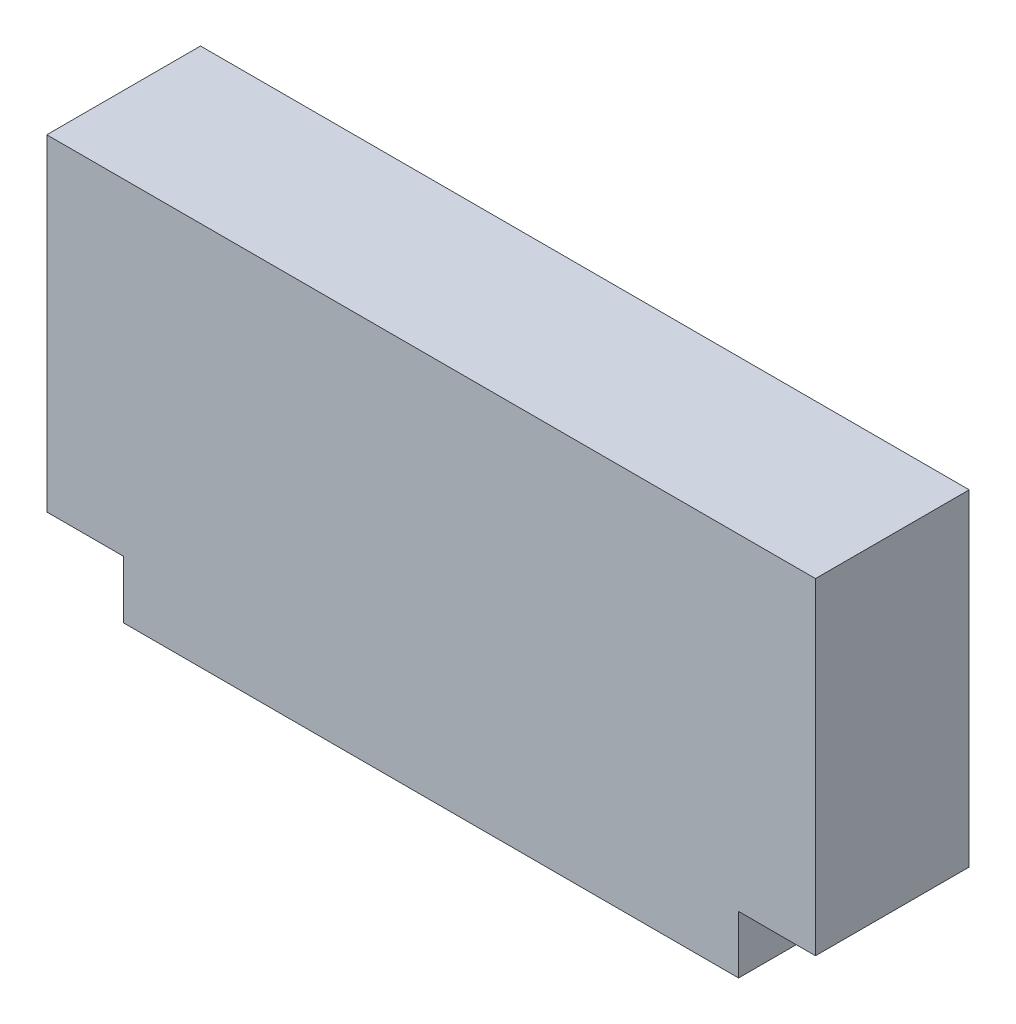
ISO-10303-21;
HEADER;
FILE_DESCRIPTION(('STEP AP214'),'2;1');
FILE_NAME('part.step','',(''),(''),'','','');
FILE_SCHEMA(('AUTOMOTIVE_DESIGN { 1 0 10303 214 1 1 1 1 }'));
ENDSEC;
DATA;
#1=APPLICATION_CONTEXT('core data for automotive mechanical design processes');
#2=APPLICATION_PROTOCOL_DEFINITION('international standard','automotive_design',2000,#1);
#3=PRODUCT_CONTEXT('',#1,'mechanical');
#4=PRODUCT('Part','Part','',(#3));
#5=PRODUCT_RELATED_PRODUCT_CATEGORY('part','',(#4));
#6=PRODUCT_DEFINITION_FORMATION('','',#4);
#7=PRODUCT_DEFINITION_CONTEXT('part definition',#1,'design');
#8=PRODUCT_DEFINITION('design','',#6,#7);
#9=PRODUCT_DEFINITION_SHAPE('','',#8);
#10=(LENGTH_UNIT() NAMED_UNIT(*) SI_UNIT(.MILLI.,.METRE.));
#11=(NAMED_UNIT(*) PLANE_ANGLE_UNIT() SI_UNIT($,.RADIAN.));
#12=(NAMED_UNIT(*) SI_UNIT($,.STERADIAN.) SOLID_ANGLE_UNIT());
#13=UNCERTAINTY_MEASURE_WITH_UNIT(LENGTH_MEASURE(1.E-05),#10,'distance_accuracy_value','');
#14=(GEOMETRIC_REPRESENTATION_CONTEXT(3) GLOBAL_UNCERTAINTY_ASSIGNED_CONTEXT((#13)) GLOBAL_UNIT_ASSIGNED_CONTEXT((#10,
#11,#12)) REPRESENTATION_CONTEXT('',''));
#15=CARTESIAN_POINT('',(0.,0.,0.));
#16=DIRECTION('',(0.,0.,1.));
#17=DIRECTION('',(1.,0.,0.));
#18=AXIS2_PLACEMENT_3D('',#15,#16,#17);
#19=CARTESIAN_POINT('',(20.,3.,8.));
#20=DIRECTION('',(-1.,0.,0.));
#21=DIRECTION('',(0.,-1.,0.));
#22=AXIS2_PLACEMENT_3D('',#19,#20,#21);
#23=PLANE('',#22);
#24=DIRECTION('',(0.,1.,0.));
#25=VECTOR('',#24,1.);
#26=CARTESIAN_POINT('',(20.,3.,0.));
#27=LINE('',#26,#25);
#28=CARTESIAN_POINT('',(20.,3.,0.));
#29=VERTEX_POINT('',#28);
#30=CARTESIAN_POINT('',(20.,20.,0.));
#31=VERTEX_POINT('',#30);
#32=EDGE_CURVE('E130',#29,#31,#27,.T.);
#33=ORIENTED_EDGE('',*,*,#32,.T.);
#34=DIRECTION('',(0.,0.,-1.));
#35=VECTOR('',#34,1.);
#36=CARTESIAN_POINT('',(20.,20.,8.));
#37=LINE('',#36,#35);
#38=CARTESIAN_POINT('',(20.,20.,8.));
#39=VERTEX_POINT('',#38);
#40=EDGE_CURVE('E11',#39,#31,#37,.T.);
#41=ORIENTED_EDGE('',*,*,#40,.F.);
#42=DIRECTION('',(0.,1.,0.));
#43=VECTOR('',#42,1.);
#44=CARTESIAN_POINT('',(20.,3.,8.));
#45=LINE('',#44,#43);
#46=CARTESIAN_POINT('',(20.,3.,8.));
#47=VERTEX_POINT('',#46);
#48=EDGE_CURVE('E144',#47,#39,#45,.T.);
#49=ORIENTED_EDGE('',*,*,#48,.F.);
#50=DIRECTION('',(0.,0.,-1.));
#51=VECTOR('',#50,1.);
#52=CARTESIAN_POINT('',(20.,3.,8.));
#53=LINE('',#52,#51);
#54=EDGE_CURVE('E126',#47,#29,#53,.T.);
#55=ORIENTED_EDGE('',*,*,#54,.T.);
#56=EDGE_LOOP('',(#33,#41,#49,#55));
#57=FACE_BOUND('',#56,.T.);
#58=ADVANCED_FACE('F34',(#57),#23,.F.);
#59=CARTESIAN_POINT('',(-20.,20.,8.));
#60=DIRECTION('',(0.,-1.,0.));
#61=DIRECTION('',(0.,0.,-1.));
#62=AXIS2_PLACEMENT_3D('',#59,#60,#61);
#63=PLANE('',#62);
#64=DIRECTION('',(-1.,0.,0.));
#65=VECTOR('',#64,1.);
#66=CARTESIAN_POINT('',(-20.,20.,0.));
#67=LINE('',#66,#65);
#68=CARTESIAN_POINT('',(-20.,20.,0.));
#69=VERTEX_POINT('',#68);
#70=EDGE_CURVE('E133',#31,#69,#67,.T.);
#71=ORIENTED_EDGE('',*,*,#70,.T.);
#72=DIRECTION('',(0.,0.,-1.));
#73=VECTOR('',#72,1.);
#74=CARTESIAN_POINT('',(-20.,20.,8.));
#75=LINE('',#74,#73);
#76=CARTESIAN_POINT('',(-20.,20.,8.));
#77=VERTEX_POINT('',#76);
#78=EDGE_CURVE('E42',#77,#69,#75,.T.);
#79=ORIENTED_EDGE('',*,*,#78,.F.);
#80=DIRECTION('',(-1.,0.,0.));
#81=VECTOR('',#80,1.);
#82=CARTESIAN_POINT('',(-20.,20.,8.));
#83=LINE('',#82,#81);
#84=EDGE_CURVE('E93',#39,#77,#83,.T.);
#85=ORIENTED_EDGE('',*,*,#84,.F.);
#86=ORIENTED_EDGE('',*,*,#40,.T.);
#87=EDGE_LOOP('',(#71,#79,#85,#86));
#88=FACE_BOUND('',#87,.T.);
#89=ADVANCED_FACE('F179',(#88),#63,.F.);
#90=CARTESIAN_POINT('',(-20.,3.,8.));
#91=DIRECTION('',(1.,0.,0.));
#92=DIRECTION('',(0.,0.,-1.));
#93=AXIS2_PLACEMENT_3D('',#90,#91,#92);
#94=PLANE('',#93);
#95=DIRECTION('',(0.,-1.,0.));
#96=VECTOR('',#95,1.);
#97=CARTESIAN_POINT('',(-20.,3.,0.));
#98=LINE('',#97,#96);
#99=CARTESIAN_POINT('',(-20.,3.,0.));
#100=VERTEX_POINT('',#99);
#101=EDGE_CURVE('E135',#69,#100,#98,.T.);
#102=ORIENTED_EDGE('',*,*,#101,.T.);
#103=DIRECTION('',(0.,0.,-1.));
#104=VECTOR('',#103,1.);
#105=CARTESIAN_POINT('',(-20.,3.,8.));
#106=LINE('',#105,#104);
#107=CARTESIAN_POINT('',(-20.,3.,8.));
#108=VERTEX_POINT('',#107);
#109=EDGE_CURVE('E151',#108,#100,#106,.T.);
#110=ORIENTED_EDGE('',*,*,#109,.F.);
#111=DIRECTION('',(0.,-1.,0.));
#112=VECTOR('',#111,1.);
#113=CARTESIAN_POINT('',(-20.,3.,8.));
#114=LINE('',#113,#112);
#115=EDGE_CURVE('E159',#77,#108,#114,.T.);
#116=ORIENTED_EDGE('',*,*,#115,.F.);
#117=ORIENTED_EDGE('',*,*,#78,.T.);
#118=EDGE_LOOP('',(#102,#110,#116,#117));
#119=FACE_BOUND('',#118,.T.);
#120=ADVANCED_FACE('F157',(#119),#94,.F.);
#121=CARTESIAN_POINT('',(-20.,3.,8.));
#122=DIRECTION('',(0.,1.,0.));
#123=DIRECTION('',(0.,0.,1.));
#124=AXIS2_PLACEMENT_3D('',#121,#122,#123);
#125=PLANE('',#124);
#126=DIRECTION('',(1.,0.,0.));
#127=VECTOR('',#126,1.);
#128=CARTESIAN_POINT('',(-20.,3.,0.));
#129=LINE('',#128,#127);
#130=CARTESIAN_POINT('',(-16.,3.,0.));
#131=VERTEX_POINT('',#130);
#132=EDGE_CURVE('E137',#100,#131,#129,.T.);
#133=ORIENTED_EDGE('',*,*,#132,.T.);
#134=DIRECTION('',(0.,0.,-1.));
#135=VECTOR('',#134,1.);
#136=CARTESIAN_POINT('',(-16.,3.,8.));
#137=LINE('',#136,#135);
#138=CARTESIAN_POINT('',(-16.,3.,8.));
#139=VERTEX_POINT('',#138);
#140=EDGE_CURVE('E148',#139,#131,#137,.T.);
#141=ORIENTED_EDGE('',*,*,#140,.F.);
#142=DIRECTION('',(1.,0.,0.));
#143=VECTOR('',#142,1.);
#144=CARTESIAN_POINT('',(-20.,3.,8.));
#145=LINE('',#144,#143);
#146=EDGE_CURVE('E171',#108,#139,#145,.T.);
#147=ORIENTED_EDGE('',*,*,#146,.F.);
#148=ORIENTED_EDGE('',*,*,#109,.T.);
#149=EDGE_LOOP('',(#133,#141,#147,#148));
#150=FACE_BOUND('',#149,.T.);
#151=ADVANCED_FACE('F167',(#150),#125,.F.);
#152=CARTESIAN_POINT('',(-16.,3.,8.));
#153=DIRECTION('',(1.,0.,0.));
#154=DIRECTION('',(0.,0.,-1.));
#155=AXIS2_PLACEMENT_3D('',#152,#153,#154);
#156=PLANE('',#155);
#157=DIRECTION('',(0.,-1.,0.));
#158=VECTOR('',#157,1.);
#159=CARTESIAN_POINT('',(-16.,3.,0.));
#160=LINE('',#159,#158);
#161=CARTESIAN_POINT('',(-16.,0.,0.));
#162=VERTEX_POINT('',#161);
#163=EDGE_CURVE('E139',#131,#162,#160,.T.);
#164=ORIENTED_EDGE('',*,*,#163,.T.);
#165=DIRECTION('',(0.,0.,-1.));
#166=VECTOR('',#165,1.);
#167=CARTESIAN_POINT('',(-16.,0.,8.));
#168=LINE('',#167,#166);
#169=CARTESIAN_POINT('',(-16.,0.,8.));
#170=VERTEX_POINT('',#169);
#171=EDGE_CURVE('E121',#170,#162,#168,.T.);
#172=ORIENTED_EDGE('',*,*,#171,.F.);
#173=DIRECTION('',(0.,-1.,0.));
#174=VECTOR('',#173,1.);
#175=CARTESIAN_POINT('',(-16.,3.,8.));
#176=LINE('',#175,#174);
#177=EDGE_CURVE('E112',#139,#170,#176,.T.);
#178=ORIENTED_EDGE('',*,*,#177,.F.);
#179=ORIENTED_EDGE('',*,*,#140,.T.);
#180=EDGE_LOOP('',(#164,#172,#178,#179));
#181=FACE_BOUND('',#180,.T.);
#182=ADVANCED_FACE('F170',(#181),#156,.F.);
#183=CARTESIAN_POINT('',(-16.,0.,8.));
#184=DIRECTION('',(0.,1.,0.));
#185=DIRECTION('',(0.,0.,1.));
#186=AXIS2_PLACEMENT_3D('',#183,#184,#185);
#187=PLANE('',#186);
#188=DIRECTION('',(1.,0.,0.));
#189=VECTOR('',#188,1.);
#190=CARTESIAN_POINT('',(-16.,0.,0.));
#191=LINE('',#190,#189);
#192=CARTESIAN_POINT('',(16.,0.,0.));
#193=VERTEX_POINT('',#192);
#194=EDGE_CURVE('E120',#162,#193,#191,.T.);
#195=ORIENTED_EDGE('',*,*,#194,.T.);
#196=DIRECTION('',(0.,0.,-1.));
#197=VECTOR('',#196,1.);
#198=CARTESIAN_POINT('',(16.,0.,8.));
#199=LINE('',#198,#197);
#200=CARTESIAN_POINT('',(16.,0.,8.));
#201=VERTEX_POINT('',#200);
#202=EDGE_CURVE('E117',#201,#193,#199,.T.);
#203=ORIENTED_EDGE('',*,*,#202,.F.);
#204=DIRECTION('',(1.,0.,0.));
#205=VECTOR('',#204,1.);
#206=CARTESIAN_POINT('',(-16.,0.,8.));
#207=LINE('',#206,#205);
#208=EDGE_CURVE('E106',#170,#201,#207,.T.);
#209=ORIENTED_EDGE('',*,*,#208,.F.);
#210=ORIENTED_EDGE('',*,*,#171,.T.);
#211=EDGE_LOOP('',(#195,#203,#209,#210));
#212=FACE_BOUND('',#211,.T.);
#213=ADVANCED_FACE('F118',(#212),#187,.F.);
#214=CARTESIAN_POINT('',(16.,3.,8.));
#215=DIRECTION('',(-1.,0.,0.));
#216=DIRECTION('',(0.,0.,1.));
#217=AXIS2_PLACEMENT_3D('',#214,#215,#216);
#218=PLANE('',#217);
#219=DIRECTION('',(0.,1.,0.));
#220=VECTOR('',#219,1.);
#221=CARTESIAN_POINT('',(16.,3.,0.));
#222=LINE('',#221,#220);
#223=CARTESIAN_POINT('',(16.,3.,0.));
#224=VERTEX_POINT('',#223);
#225=EDGE_CURVE('E79',#193,#224,#222,.T.);
#226=ORIENTED_EDGE('',*,*,#225,.T.);
#227=DIRECTION('',(0.,0.,-1.));
#228=VECTOR('',#227,1.);
#229=CARTESIAN_POINT('',(16.,3.,8.));
#230=LINE('',#229,#228);
#231=CARTESIAN_POINT('',(16.,3.,8.));
#232=VERTEX_POINT('',#231);
#233=EDGE_CURVE('E122',#232,#224,#230,.T.);
#234=ORIENTED_EDGE('',*,*,#233,.F.);
#235=DIRECTION('',(0.,1.,0.));
#236=VECTOR('',#235,1.);
#237=CARTESIAN_POINT('',(16.,3.,8.));
#238=LINE('',#237,#236);
#239=EDGE_CURVE('E110',#201,#232,#238,.T.);
#240=ORIENTED_EDGE('',*,*,#239,.F.);
#241=ORIENTED_EDGE('',*,*,#202,.T.);
#242=EDGE_LOOP('',(#226,#234,#240,#241));
#243=FACE_BOUND('',#242,.T.);
#244=ADVANCED_FACE('F124',(#243),#218,.F.);
#245=CARTESIAN_POINT('',(20.,3.,8.));
#246=DIRECTION('',(0.,1.,0.));
#247=DIRECTION('',(0.,0.,1.));
#248=AXIS2_PLACEMENT_3D('',#245,#246,#247);
#249=PLANE('',#248);
#250=DIRECTION('',(1.,0.,0.));
#251=VECTOR('',#250,1.);
#252=CARTESIAN_POINT('',(20.,3.,0.));
#253=LINE('',#252,#251);
#254=EDGE_CURVE('E85',#224,#29,#253,.T.);
#255=ORIENTED_EDGE('',*,*,#254,.T.);
#256=ORIENTED_EDGE('',*,*,#54,.F.);
#257=DIRECTION('',(1.,0.,0.));
#258=VECTOR('',#257,1.);
#259=CARTESIAN_POINT('',(20.,3.,8.));
#260=LINE('',#259,#258);
#261=EDGE_CURVE('E50',#232,#47,#260,.T.);
#262=ORIENTED_EDGE('',*,*,#261,.F.);
#263=ORIENTED_EDGE('',*,*,#233,.T.);
#264=EDGE_LOOP('',(#255,#256,#262,#263));
#265=FACE_BOUND('',#264,.T.);
#266=ADVANCED_FACE('F195',(#265),#249,.F.);
#267=CARTESIAN_POINT('',(0.,0.,8.));
#268=DIRECTION('',(0.,0.,-1.));
#269=DIRECTION('',(-1.,0.,0.));
#270=AXIS2_PLACEMENT_3D('',#267,#268,#269);
#271=PLANE('',#270);
#272=ORIENTED_EDGE('',*,*,#48,.T.);
#273=ORIENTED_EDGE('',*,*,#84,.T.);
#274=ORIENTED_EDGE('',*,*,#115,.T.);
#275=ORIENTED_EDGE('',*,*,#146,.T.);
#276=ORIENTED_EDGE('',*,*,#177,.T.);
#277=ORIENTED_EDGE('',*,*,#208,.T.);
#278=ORIENTED_EDGE('',*,*,#239,.T.);
#279=ORIENTED_EDGE('',*,*,#261,.T.);
#280=EDGE_LOOP('',(#272,#273,#274,#275,#276,#277,#278,#279));
#281=FACE_BOUND('',#280,.T.);
#282=ADVANCED_FACE('F108',(#281),#271,.F.);
#283=CARTESIAN_POINT('',(0.,0.,0.));
#284=DIRECTION('',(0.,0.,-1.));
#285=DIRECTION('',(-1.,0.,0.));
#286=AXIS2_PLACEMENT_3D('',#283,#284,#285);
#287=PLANE('',#286);
#288=ORIENTED_EDGE('',*,*,#32,.F.);
#289=ORIENTED_EDGE('',*,*,#254,.F.);
#290=ORIENTED_EDGE('',*,*,#225,.F.);
#291=ORIENTED_EDGE('',*,*,#194,.F.);
#292=ORIENTED_EDGE('',*,*,#163,.F.);
#293=ORIENTED_EDGE('',*,*,#132,.F.);
#294=ORIENTED_EDGE('',*,*,#101,.F.);
#295=ORIENTED_EDGE('',*,*,#70,.F.);
#296=EDGE_LOOP('',(#288,#289,#290,#291,#292,#293,#294,#295));
#297=FACE_BOUND('',#296,.T.);
#298=ADVANCED_FACE('F163',(#297),#287,.T.);
#299=CLOSED_SHELL('',(#58,#89,#120,#151,#182,#213,#244,#266,#282,#298));
#300=MANIFOLD_SOLID_BREP('B2',#299);
#301=ADVANCED_BREP_SHAPE_REPRESENTATION('',(#18,#300),#14);
#302=SHAPE_DEFINITION_REPRESENTATION(#9,#301);
ENDSEC;
END-ISO-10303-21;
